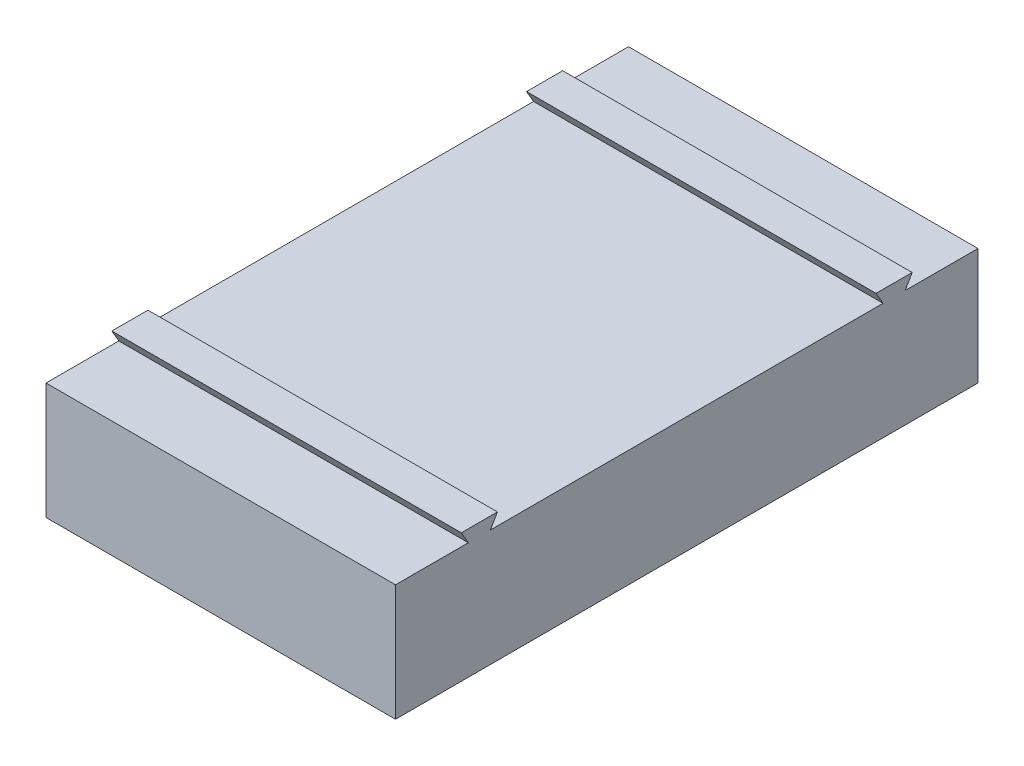
ISO-10303-21;
HEADER;
FILE_DESCRIPTION(('STEP AP214'),'2;1');
FILE_NAME('part.step','',(''),(''),'','','');
FILE_SCHEMA(('AUTOMOTIVE_DESIGN { 1 0 10303 214 1 1 1 1 }'));
ENDSEC;
DATA;
#1=APPLICATION_CONTEXT('core data for automotive mechanical design processes');
#2=APPLICATION_PROTOCOL_DEFINITION('international standard','automotive_design',2000,#1);
#3=PRODUCT_CONTEXT('',#1,'mechanical');
#4=PRODUCT('Part','Part','',(#3));
#5=PRODUCT_RELATED_PRODUCT_CATEGORY('part','',(#4));
#6=PRODUCT_DEFINITION_FORMATION('','',#4);
#7=PRODUCT_DEFINITION_CONTEXT('part definition',#1,'design');
#8=PRODUCT_DEFINITION('design','',#6,#7);
#9=PRODUCT_DEFINITION_SHAPE('','',#8);
#10=(LENGTH_UNIT() NAMED_UNIT(*) SI_UNIT(.MILLI.,.METRE.));
#11=(NAMED_UNIT(*) PLANE_ANGLE_UNIT() SI_UNIT($,.RADIAN.));
#12=(NAMED_UNIT(*) SI_UNIT($,.STERADIAN.) SOLID_ANGLE_UNIT());
#13=UNCERTAINTY_MEASURE_WITH_UNIT(LENGTH_MEASURE(1.E-05),#10,'distance_accuracy_value','');
#14=(GEOMETRIC_REPRESENTATION_CONTEXT(3) GLOBAL_UNCERTAINTY_ASSIGNED_CONTEXT((#13)) GLOBAL_UNIT_ASSIGNED_CONTEXT((#10,
#11,#12)) REPRESENTATION_CONTEXT('',''));
#15=CARTESIAN_POINT('',(0.,0.,0.));
#16=DIRECTION('',(0.,0.,1.));
#17=DIRECTION('',(1.,0.,0.));
#18=AXIS2_PLACEMENT_3D('',#15,#16,#17);
#19=CARTESIAN_POINT('',(0.,40.,0.));
#20=DIRECTION('',(0.,1.,0.));
#21=DIRECTION('',(0.,0.,1.));
#22=AXIS2_PLACEMENT_3D('',#19,#20,#21);
#23=PLANE('',#22);
#24=DIRECTION('',(1.,0.,0.));
#25=VECTOR('',#24,1.);
#26=CARTESIAN_POINT('',(-73.0825745851545,40.,67.4));
#27=LINE('',#26,#25);
#28=CARTESIAN_POINT('',(-60.,40.,67.4));
#29=VERTEX_POINT('',#28);
#30=CARTESIAN_POINT('',(60.,40.,67.4));
#31=VERTEX_POINT('',#30);
#32=EDGE_CURVE('E59',#29,#31,#27,.T.);
#33=ORIENTED_EDGE('',*,*,#32,.T.);
#34=DIRECTION('',(0.,0.,-1.));
#35=VECTOR('',#34,1.);
#36=CARTESIAN_POINT('',(60.,40.,100.));
#37=LINE('',#36,#35);
#38=CARTESIAN_POINT('',(60.,40.,-67.4));
#39=VERTEX_POINT('',#38);
#40=EDGE_CURVE('E289',#31,#39,#37,.T.);
#41=ORIENTED_EDGE('',*,*,#40,.T.);
#42=DIRECTION('',(1.,0.,0.));
#43=VECTOR('',#42,1.);
#44=CARTESIAN_POINT('',(-73.0825745851545,40.,-67.4));
#45=LINE('',#44,#43);
#46=CARTESIAN_POINT('',(-60.,40.,-67.4));
#47=VERTEX_POINT('',#46);
#48=EDGE_CURVE('E257',#47,#39,#45,.T.);
#49=ORIENTED_EDGE('',*,*,#48,.F.);
#50=DIRECTION('',(0.,0.,1.));
#51=VECTOR('',#50,1.);
#52=CARTESIAN_POINT('',(-60.,40.,100.));
#53=LINE('',#52,#51);
#54=EDGE_CURVE('E282',#47,#29,#53,.T.);
#55=ORIENTED_EDGE('',*,*,#54,.T.);
#56=EDGE_LOOP('',(#33,#41,#49,#55));
#57=FACE_BOUND('',#56,.T.);
#58=ADVANCED_FACE('F36',(#57),#23,.T.);
#59=CARTESIAN_POINT('',(-60.,40.,-100.));
#60=VERTEX_POINT('',#59);
#61=CARTESIAN_POINT('',(-60.,40.,-75.));
#62=VERTEX_POINT('',#61);
#63=EDGE_CURVE('E279',#60,#62,#53,.T.);
#64=ORIENTED_EDGE('',*,*,#63,.T.);
#65=DIRECTION('',(1.,0.,0.));
#66=VECTOR('',#65,1.);
#67=CARTESIAN_POINT('',(-73.0825745851545,40.,-75.));
#68=LINE('',#67,#66);
#69=CARTESIAN_POINT('',(60.,40.,-75.));
#70=VERTEX_POINT('',#69);
#71=EDGE_CURVE('E268',#62,#70,#68,.T.);
#72=ORIENTED_EDGE('',*,*,#71,.T.);
#73=CARTESIAN_POINT('',(60.,40.,-100.));
#74=VERTEX_POINT('',#73);
#75=EDGE_CURVE('E285',#70,#74,#37,.T.);
#76=ORIENTED_EDGE('',*,*,#75,.T.);
#77=DIRECTION('',(-1.,0.,0.));
#78=VECTOR('',#77,1.);
#79=CARTESIAN_POINT('',(60.,40.,-100.));
#80=LINE('',#79,#78);
#81=EDGE_CURVE('E288',#74,#60,#80,.T.);
#82=ORIENTED_EDGE('',*,*,#81,.T.);
#83=EDGE_LOOP('',(#64,#72,#76,#82));
#84=FACE_BOUND('',#83,.T.);
#85=ADVANCED_FACE('F327',(#84),#23,.T.);
#86=CARTESIAN_POINT('',(-60.,40.,100.));
#87=DIRECTION('',(1.,0.,0.));
#88=DIRECTION('',(0.,0.,-1.));
#89=AXIS2_PLACEMENT_3D('',#86,#87,#88);
#90=PLANE('',#89);
#91=DIRECTION('',(0.,0.,1.));
#92=VECTOR('',#91,1.);
#93=CARTESIAN_POINT('',(-60.,0.,100.));
#94=LINE('',#93,#92);
#95=CARTESIAN_POINT('',(-60.,0.,-100.));
#96=VERTEX_POINT('',#95);
#97=CARTESIAN_POINT('',(-60.,0.,100.));
#98=VERTEX_POINT('',#97);
#99=EDGE_CURVE('E278',#96,#98,#94,.T.);
#100=ORIENTED_EDGE('',*,*,#99,.T.);
#101=DIRECTION('',(0.,-1.,0.));
#102=VECTOR('',#101,1.);
#103=CARTESIAN_POINT('',(-60.,40.,100.));
#104=LINE('',#103,#102);
#105=CARTESIAN_POINT('',(-60.,40.,100.));
#106=VERTEX_POINT('',#105);
#107=EDGE_CURVE('E11',#106,#98,#104,.T.);
#108=ORIENTED_EDGE('',*,*,#107,.F.);
#109=CARTESIAN_POINT('',(-60.,40.,75.));
#110=VERTEX_POINT('',#109);
#111=EDGE_CURVE('E283',#110,#106,#53,.T.);
#112=ORIENTED_EDGE('',*,*,#111,.F.);
#113=DIRECTION('',(0.,0.866025403784436,0.500000000000005));
#114=VECTOR('',#113,1.);
#115=CARTESIAN_POINT('',(-60.,40.,75.));
#116=LINE('',#115,#114);
#117=CARTESIAN_POINT('',(-60.,44.16,77.4017771198289));
#118=VERTEX_POINT('',#117);
#119=EDGE_CURVE('E230',#110,#118,#116,.T.);
#120=ORIENTED_EDGE('',*,*,#119,.T.);
#121=DIRECTION('',(0.,0.,-1.));
#122=VECTOR('',#121,1.);
#123=CARTESIAN_POINT('',(-60.,44.16,77.4017771198289));
#124=LINE('',#123,#122);
#125=CARTESIAN_POINT('',(-60.,44.16,64.9982228801711));
#126=VERTEX_POINT('',#125);
#127=EDGE_CURVE('E235',#118,#126,#124,.T.);
#128=ORIENTED_EDGE('',*,*,#127,.T.);
#129=DIRECTION('',(0.,-0.866025403784436,0.500000000000004));
#130=VECTOR('',#129,1.);
#131=CARTESIAN_POINT('',(-60.,44.16,64.9982228801711));
#132=LINE('',#131,#130);
#133=EDGE_CURVE('E232',#126,#29,#132,.T.);
#134=ORIENTED_EDGE('',*,*,#133,.T.);
#135=ORIENTED_EDGE('',*,*,#54,.F.);
#136=DIRECTION('',(0.,0.866025403784436,0.500000000000005));
#137=VECTOR('',#136,1.);
#138=CARTESIAN_POINT('',(-60.,40.,-67.4));
#139=LINE('',#138,#137);
#140=CARTESIAN_POINT('',(-60.,44.16,-64.9982228801712));
#141=VERTEX_POINT('',#140);
#142=EDGE_CURVE('E256',#47,#141,#139,.T.);
#143=ORIENTED_EDGE('',*,*,#142,.T.);
#144=DIRECTION('',(0.,0.,-1.));
#145=VECTOR('',#144,1.);
#146=CARTESIAN_POINT('',(-60.,44.16,-64.9982228801712));
#147=LINE('',#146,#145);
#148=CARTESIAN_POINT('',(-60.,44.16,-77.4017771198289));
#149=VERTEX_POINT('',#148);
#150=EDGE_CURVE('E254',#141,#149,#147,.T.);
#151=ORIENTED_EDGE('',*,*,#150,.T.);
#152=DIRECTION('',(0.,-0.866025403784436,0.500000000000005));
#153=VECTOR('',#152,1.);
#154=CARTESIAN_POINT('',(-60.,44.16,-77.4017771198289));
#155=LINE('',#154,#153);
#156=EDGE_CURVE('E259',#149,#62,#155,.T.);
#157=ORIENTED_EDGE('',*,*,#156,.T.);
#158=ORIENTED_EDGE('',*,*,#63,.F.);
#159=DIRECTION('',(0.,-1.,0.));
#160=VECTOR('',#159,1.);
#161=CARTESIAN_POINT('',(-60.,40.,-100.));
#162=LINE('',#161,#160);
#163=EDGE_CURVE('E291',#60,#96,#162,.T.);
#164=ORIENTED_EDGE('',*,*,#163,.T.);
#165=EDGE_LOOP('',(#100,#108,#112,#120,#128,#134,#135,#143,#151,#157,#158,#164));
#166=FACE_BOUND('',#165,.T.);
#167=ADVANCED_FACE('F38',(#166),#90,.F.);
#168=CARTESIAN_POINT('',(60.,40.,100.));
#169=DIRECTION('',(0.,0.,-1.));
#170=DIRECTION('',(-1.,0.,0.));
#171=AXIS2_PLACEMENT_3D('',#168,#169,#170);
#172=PLANE('',#171);
#173=DIRECTION('',(1.,0.,0.));
#174=VECTOR('',#173,1.);
#175=CARTESIAN_POINT('',(60.,0.,100.));
#176=LINE('',#175,#174);
#177=CARTESIAN_POINT('',(60.,0.,100.));
#178=VERTEX_POINT('',#177);
#179=EDGE_CURVE('E294',#98,#178,#176,.T.);
#180=ORIENTED_EDGE('',*,*,#179,.T.);
#181=DIRECTION('',(0.,-1.,0.));
#182=VECTOR('',#181,1.);
#183=CARTESIAN_POINT('',(60.,40.,100.));
#184=LINE('',#183,#182);
#185=CARTESIAN_POINT('',(60.,40.,100.));
#186=VERTEX_POINT('',#185);
#187=EDGE_CURVE('E44',#186,#178,#184,.T.);
#188=ORIENTED_EDGE('',*,*,#187,.F.);
#189=DIRECTION('',(1.,0.,0.));
#190=VECTOR('',#189,1.);
#191=CARTESIAN_POINT('',(60.,40.,100.));
#192=LINE('',#191,#190);
#193=EDGE_CURVE('E281',#106,#186,#192,.T.);
#194=ORIENTED_EDGE('',*,*,#193,.F.);
#195=ORIENTED_EDGE('',*,*,#107,.T.);
#196=EDGE_LOOP('',(#180,#188,#194,#195));
#197=FACE_BOUND('',#196,.T.);
#198=ADVANCED_FACE('F347',(#197),#172,.F.);
#199=CARTESIAN_POINT('',(60.,40.,100.));
#200=DIRECTION('',(-1.,0.,0.));
#201=DIRECTION('',(0.,0.,1.));
#202=AXIS2_PLACEMENT_3D('',#199,#200,#201);
#203=PLANE('',#202);
#204=DIRECTION('',(0.,0.,-1.));
#205=VECTOR('',#204,1.);
#206=CARTESIAN_POINT('',(60.,0.,100.));
#207=LINE('',#206,#205);
#208=CARTESIAN_POINT('',(60.,0.,-100.));
#209=VERTEX_POINT('',#208);
#210=EDGE_CURVE('E296',#178,#209,#207,.T.);
#211=ORIENTED_EDGE('',*,*,#210,.T.);
#212=DIRECTION('',(0.,-1.,0.));
#213=VECTOR('',#212,1.);
#214=CARTESIAN_POINT('',(60.,40.,-100.));
#215=LINE('',#214,#213);
#216=EDGE_CURVE('E302',#74,#209,#215,.T.);
#217=ORIENTED_EDGE('',*,*,#216,.F.);
#218=ORIENTED_EDGE('',*,*,#75,.F.);
#219=DIRECTION('',(0.,0.866025403784436,-0.500000000000005));
#220=VECTOR('',#219,1.);
#221=CARTESIAN_POINT('',(60.,44.16,-77.4017771198289));
#222=LINE('',#221,#220);
#223=CARTESIAN_POINT('',(60.,44.16,-77.4017771198289));
#224=VERTEX_POINT('',#223);
#225=EDGE_CURVE('E253',#70,#224,#222,.T.);
#226=ORIENTED_EDGE('',*,*,#225,.T.);
#227=DIRECTION('',(0.,0.,1.));
#228=VECTOR('',#227,1.);
#229=CARTESIAN_POINT('',(60.,44.16,-64.9982228801712));
#230=LINE('',#229,#228);
#231=CARTESIAN_POINT('',(60.,44.16,-64.9982228801712));
#232=VERTEX_POINT('',#231);
#233=EDGE_CURVE('E262',#224,#232,#230,.T.);
#234=ORIENTED_EDGE('',*,*,#233,.T.);
#235=DIRECTION('',(0.,-0.866025403784436,-0.500000000000005));
#236=VECTOR('',#235,1.);
#237=CARTESIAN_POINT('',(60.,40.,-67.4));
#238=LINE('',#237,#236);
#239=EDGE_CURVE('E265',#232,#39,#238,.T.);
#240=ORIENTED_EDGE('',*,*,#239,.T.);
#241=ORIENTED_EDGE('',*,*,#40,.F.);
#242=DIRECTION('',(0.,0.866025403784436,-0.500000000000004));
#243=VECTOR('',#242,1.);
#244=CARTESIAN_POINT('',(60.,44.16,64.9982228801711));
#245=LINE('',#244,#243);
#246=CARTESIAN_POINT('',(60.,44.16,64.9982228801711));
#247=VERTEX_POINT('',#246);
#248=EDGE_CURVE('E220',#31,#247,#245,.T.);
#249=ORIENTED_EDGE('',*,*,#248,.T.);
#250=DIRECTION('',(0.,0.,1.));
#251=VECTOR('',#250,1.);
#252=CARTESIAN_POINT('',(60.,44.16,77.4017771198289));
#253=LINE('',#252,#251);
#254=CARTESIAN_POINT('',(60.,44.16,77.4017771198289));
#255=VERTEX_POINT('',#254);
#256=EDGE_CURVE('E238',#247,#255,#253,.T.);
#257=ORIENTED_EDGE('',*,*,#256,.T.);
#258=DIRECTION('',(0.,-0.866025403784436,-0.500000000000005));
#259=VECTOR('',#258,1.);
#260=CARTESIAN_POINT('',(60.,40.,75.));
#261=LINE('',#260,#259);
#262=CARTESIAN_POINT('',(60.,40.,75.));
#263=VERTEX_POINT('',#262);
#264=EDGE_CURVE('E241',#255,#263,#261,.T.);
#265=ORIENTED_EDGE('',*,*,#264,.T.);
#266=EDGE_CURVE('E286',#186,#263,#37,.T.);
#267=ORIENTED_EDGE('',*,*,#266,.F.);
#268=ORIENTED_EDGE('',*,*,#187,.T.);
#269=EDGE_LOOP('',(#211,#217,#218,#226,#234,#240,#241,#249,#257,#265,#267,#268));
#270=FACE_BOUND('',#269,.T.);
#271=ADVANCED_FACE('F309',(#270),#203,.F.);
#272=CARTESIAN_POINT('',(60.,40.,-100.));
#273=DIRECTION('',(0.,0.,1.));
#274=DIRECTION('',(1.,0.,0.));
#275=AXIS2_PLACEMENT_3D('',#272,#273,#274);
#276=PLANE('',#275);
#277=DIRECTION('',(-1.,0.,0.));
#278=VECTOR('',#277,1.);
#279=CARTESIAN_POINT('',(60.,0.,-100.));
#280=LINE('',#279,#278);
#281=EDGE_CURVE('E298',#209,#96,#280,.T.);
#282=ORIENTED_EDGE('',*,*,#281,.T.);
#283=ORIENTED_EDGE('',*,*,#163,.F.);
#284=ORIENTED_EDGE('',*,*,#81,.F.);
#285=ORIENTED_EDGE('',*,*,#216,.T.);
#286=EDGE_LOOP('',(#282,#283,#284,#285));
#287=FACE_BOUND('',#286,.T.);
#288=ADVANCED_FACE('F319',(#287),#276,.F.);
#289=DIRECTION('',(1.,0.,0.));
#290=VECTOR('',#289,1.);
#291=CARTESIAN_POINT('',(-73.0825745851545,40.,75.));
#292=LINE('',#291,#290);
#293=EDGE_CURVE('E246',#110,#263,#292,.T.);
#294=ORIENTED_EDGE('',*,*,#293,.F.);
#295=ORIENTED_EDGE('',*,*,#111,.T.);
#296=ORIENTED_EDGE('',*,*,#193,.T.);
#297=ORIENTED_EDGE('',*,*,#266,.T.);
#298=EDGE_LOOP('',(#294,#295,#296,#297));
#299=FACE_BOUND('',#298,.T.);
#300=ADVANCED_FACE('F345',(#299),#23,.T.);
#301=CARTESIAN_POINT('',(0.,0.,0.));
#302=DIRECTION('',(0.,1.,0.));
#303=DIRECTION('',(0.,0.,1.));
#304=AXIS2_PLACEMENT_3D('',#301,#302,#303);
#305=PLANE('',#304);
#306=DIRECTION('',(0.,0.,1.));
#307=VECTOR('',#306,1.);
#308=CARTESIAN_POINT('',(10.8887433026897,0.,13.3243832519748));
#309=LINE('',#308,#307);
#310=CARTESIAN_POINT('',(10.8887433026897,0.,-30.1350746666546));
#311=VERTEX_POINT('',#310);
#312=CARTESIAN_POINT('',(10.8887433026897,0.,13.3243832519748));
#313=VERTEX_POINT('',#312);
#314=EDGE_CURVE('E205',#311,#313,#309,.T.);
#315=ORIENTED_EDGE('',*,*,#314,.F.);
#316=DIRECTION('',(1.,0.,0.));
#317=VECTOR('',#316,1.);
#318=CARTESIAN_POINT('',(10.8887433026897,0.,-30.1350746666546));
#319=LINE('',#318,#317);
#320=CARTESIAN_POINT('',(-10.8887433026829,0.,-30.1350746666546));
#321=VERTEX_POINT('',#320);
#322=EDGE_CURVE('E51',#321,#311,#319,.T.);
#323=ORIENTED_EDGE('',*,*,#322,.F.);
#324=DIRECTION('',(0.,0.,-1.));
#325=VECTOR('',#324,1.);
#326=CARTESIAN_POINT('',(-10.8887433026829,0.,-30.1350746666546));
#327=LINE('',#326,#325);
#328=CARTESIAN_POINT('',(-10.8887433026829,0.,13.3243832519748));
#329=VERTEX_POINT('',#328);
#330=EDGE_CURVE('E188',#329,#321,#327,.T.);
#331=ORIENTED_EDGE('',*,*,#330,.F.);
#332=DIRECTION('',(1.,0.,0.));
#333=VECTOR('',#332,1.);
#334=CARTESIAN_POINT('',(-10.8887433026829,0.,13.3243832519748));
#335=LINE('',#334,#333);
#336=CARTESIAN_POINT('',(-25.4837020685664,0.,13.3243832519748));
#337=VERTEX_POINT('',#336);
#338=EDGE_CURVE('E191',#337,#329,#335,.T.);
#339=ORIENTED_EDGE('',*,*,#338,.F.);
#340=DIRECTION('',(-0.683415844772554,0.,-0.73002930291449));
#341=VECTOR('',#340,1.);
#342=CARTESIAN_POINT('',(-25.4837020685664,0.,13.3243832519748));
#343=LINE('',#342,#341);
#344=CARTESIAN_POINT('',(3.41637121107795E-12,0.,40.5462415087));
#345=VERTEX_POINT('',#344);
#346=EDGE_CURVE('E213',#345,#337,#343,.T.);
#347=ORIENTED_EDGE('',*,*,#346,.F.);
#348=DIRECTION('',(-0.683415844772554,0.,0.73002930291449));
#349=VECTOR('',#348,1.);
#350=CARTESIAN_POINT('',(3.41637121107795E-12,0.,40.5462415087));
#351=LINE('',#350,#349);
#352=CARTESIAN_POINT('',(25.4837020685733,0.,13.3243832519748));
#353=VERTEX_POINT('',#352);
#354=EDGE_CURVE('E210',#353,#345,#351,.T.);
#355=ORIENTED_EDGE('',*,*,#354,.F.);
#356=DIRECTION('',(1.,0.,0.));
#357=VECTOR('',#356,1.);
#358=CARTESIAN_POINT('',(25.4837020685733,0.,13.3243832519748));
#359=LINE('',#358,#357);
#360=EDGE_CURVE('E207',#313,#353,#359,.T.);
#361=ORIENTED_EDGE('',*,*,#360,.F.);
#362=EDGE_LOOP('',(#315,#323,#331,#339,#347,#355,#361));
#363=FACE_BOUND('',#362,.T.);
#364=ORIENTED_EDGE('',*,*,#99,.F.);
#365=ORIENTED_EDGE('',*,*,#281,.F.);
#366=ORIENTED_EDGE('',*,*,#210,.F.);
#367=ORIENTED_EDGE('',*,*,#179,.F.);
#368=EDGE_LOOP('',(#364,#365,#366,#367));
#369=FACE_BOUND('',#368,.T.);
#370=ADVANCED_FACE('F316',(#363,#369),#305,.F.);
#371=CARTESIAN_POINT('',(-73.0825745851545,40.,-67.4));
#372=DIRECTION('',(0.,-0.500000000000005,0.866025403784436));
#373=DIRECTION('',(0.,-0.866025403784436,-0.500000000000005));
#374=AXIS2_PLACEMENT_3D('',#371,#372,#373);
#375=PLANE('',#374);
#376=ORIENTED_EDGE('',*,*,#142,.F.);
#377=ORIENTED_EDGE('',*,*,#48,.T.);
#378=ORIENTED_EDGE('',*,*,#239,.F.);
#379=DIRECTION('',(1.,0.,0.));
#380=VECTOR('',#379,1.);
#381=CARTESIAN_POINT('',(-73.0825745851545,44.16,-64.9982228801712));
#382=LINE('',#381,#380);
#383=EDGE_CURVE('E271',#141,#232,#382,.T.);
#384=ORIENTED_EDGE('',*,*,#383,.F.);
#385=EDGE_LOOP('',(#376,#377,#378,#384));
#386=FACE_BOUND('',#385,.T.);
#387=ADVANCED_FACE('F335',(#386),#375,.T.);
#388=CARTESIAN_POINT('',(-73.0825745851545,44.16,-64.9982228801712));
#389=DIRECTION('',(0.,1.,0.));
#390=DIRECTION('',(0.,0.,1.));
#391=AXIS2_PLACEMENT_3D('',#388,#389,#390);
#392=PLANE('',#391);
#393=ORIENTED_EDGE('',*,*,#150,.F.);
#394=ORIENTED_EDGE('',*,*,#383,.T.);
#395=ORIENTED_EDGE('',*,*,#233,.F.);
#396=DIRECTION('',(1.,0.,0.));
#397=VECTOR('',#396,1.);
#398=CARTESIAN_POINT('',(-73.0825745851545,44.16,-77.4017771198289));
#399=LINE('',#398,#397);
#400=EDGE_CURVE('E273',#149,#224,#399,.T.);
#401=ORIENTED_EDGE('',*,*,#400,.F.);
#402=EDGE_LOOP('',(#393,#394,#395,#401));
#403=FACE_BOUND('',#402,.T.);
#404=ADVANCED_FACE('F341',(#403),#392,.T.);
#405=CARTESIAN_POINT('',(-73.0825745851545,44.16,-77.4017771198289));
#406=DIRECTION('',(0.,-0.500000000000005,-0.866025403784436));
#407=DIRECTION('',(0.,0.866025403784436,-0.500000000000005));
#408=AXIS2_PLACEMENT_3D('',#405,#406,#407);
#409=PLANE('',#408);
#410=ORIENTED_EDGE('',*,*,#156,.F.);
#411=ORIENTED_EDGE('',*,*,#400,.T.);
#412=ORIENTED_EDGE('',*,*,#225,.F.);
#413=ORIENTED_EDGE('',*,*,#71,.F.);
#414=EDGE_LOOP('',(#410,#411,#412,#413));
#415=FACE_BOUND('',#414,.T.);
#416=ADVANCED_FACE('F402',(#415),#409,.T.);
#417=CARTESIAN_POINT('',(-73.0825745851545,44.16,64.9982228801711));
#418=DIRECTION('',(0.,-0.500000000000004,-0.866025403784436));
#419=DIRECTION('',(0.,0.866025403784436,-0.500000000000004));
#420=AXIS2_PLACEMENT_3D('',#417,#418,#419);
#421=PLANE('',#420);
#422=ORIENTED_EDGE('',*,*,#133,.F.);
#423=DIRECTION('',(1.,0.,0.));
#424=VECTOR('',#423,1.);
#425=CARTESIAN_POINT('',(-73.0825745851545,44.16,64.9982228801711));
#426=LINE('',#425,#424);
#427=EDGE_CURVE('E244',#126,#247,#426,.T.);
#428=ORIENTED_EDGE('',*,*,#427,.T.);
#429=ORIENTED_EDGE('',*,*,#248,.F.);
#430=ORIENTED_EDGE('',*,*,#32,.F.);
#431=EDGE_LOOP('',(#422,#428,#429,#430));
#432=FACE_BOUND('',#431,.T.);
#433=ADVANCED_FACE('F411',(#432),#421,.T.);
#434=CARTESIAN_POINT('',(-73.0825745851545,40.,75.));
#435=DIRECTION('',(0.,-0.500000000000005,0.866025403784436));
#436=DIRECTION('',(0.,-0.866025403784436,-0.500000000000005));
#437=AXIS2_PLACEMENT_3D('',#434,#435,#436);
#438=PLANE('',#437);
#439=ORIENTED_EDGE('',*,*,#119,.F.);
#440=ORIENTED_EDGE('',*,*,#293,.T.);
#441=ORIENTED_EDGE('',*,*,#264,.F.);
#442=DIRECTION('',(1.,0.,0.));
#443=VECTOR('',#442,1.);
#444=CARTESIAN_POINT('',(-73.0825745851545,44.16,77.4017771198289));
#445=LINE('',#444,#443);
#446=EDGE_CURVE('E249',#118,#255,#445,.T.);
#447=ORIENTED_EDGE('',*,*,#446,.F.);
#448=EDGE_LOOP('',(#439,#440,#441,#447));
#449=FACE_BOUND('',#448,.T.);
#450=ADVANCED_FACE('F420',(#449),#438,.T.);
#451=CARTESIAN_POINT('',(-73.0825745851545,44.16,77.4017771198289));
#452=DIRECTION('',(0.,1.,0.));
#453=DIRECTION('',(0.,0.,1.));
#454=AXIS2_PLACEMENT_3D('',#451,#452,#453);
#455=PLANE('',#454);
#456=ORIENTED_EDGE('',*,*,#127,.F.);
#457=ORIENTED_EDGE('',*,*,#446,.T.);
#458=ORIENTED_EDGE('',*,*,#256,.F.);
#459=ORIENTED_EDGE('',*,*,#427,.F.);
#460=EDGE_LOOP('',(#456,#457,#458,#459));
#461=FACE_BOUND('',#460,.T.);
#462=ADVANCED_FACE('F430',(#461),#455,.T.);
#463=CARTESIAN_POINT('',(10.8887433026897,1.,-30.1350746666546));
#464=DIRECTION('',(0.,0.,-1.));
#465=DIRECTION('',(-1.,0.,0.));
#466=AXIS2_PLACEMENT_3D('',#463,#464,#465);
#467=PLANE('',#466);
#468=ORIENTED_EDGE('',*,*,#322,.T.);
#469=DIRECTION('',(0.,-1.,0.));
#470=VECTOR('',#469,1.);
#471=CARTESIAN_POINT('',(10.8887433026897,1.,-30.1350746666546));
#472=LINE('',#471,#470);
#473=CARTESIAN_POINT('',(10.8887433026897,1.,-30.1350746666546));
#474=VERTEX_POINT('',#473);
#475=EDGE_CURVE('E165',#474,#311,#472,.T.);
#476=ORIENTED_EDGE('',*,*,#475,.F.);
#477=DIRECTION('',(1.,0.,0.));
#478=VECTOR('',#477,1.);
#479=CARTESIAN_POINT('',(10.8887433026897,1.,-30.1350746666546));
#480=LINE('',#479,#478);
#481=CARTESIAN_POINT('',(-10.8887433026829,1.,-30.1350746666546));
#482=VERTEX_POINT('',#481);
#483=EDGE_CURVE('E169',#482,#474,#480,.T.);
#484=ORIENTED_EDGE('',*,*,#483,.F.);
#485=DIRECTION('',(0.,-1.,0.));
#486=VECTOR('',#485,1.);
#487=CARTESIAN_POINT('',(-10.8887433026829,1.,-30.1350746666546));
#488=LINE('',#487,#486);
#489=EDGE_CURVE('E218',#482,#321,#488,.T.);
#490=ORIENTED_EDGE('',*,*,#489,.T.);
#491=EDGE_LOOP('',(#468,#476,#484,#490));
#492=FACE_BOUND('',#491,.T.);
#493=ADVANCED_FACE('F167',(#492),#467,.F.);
#494=CARTESIAN_POINT('',(-10.8887433026829,1.,-30.1350746666546));
#495=DIRECTION('',(-1.,0.,0.));
#496=DIRECTION('',(0.,0.,1.));
#497=AXIS2_PLACEMENT_3D('',#494,#495,#496);
#498=PLANE('',#497);
#499=ORIENTED_EDGE('',*,*,#330,.T.);
#500=ORIENTED_EDGE('',*,*,#489,.F.);
#501=DIRECTION('',(0.,0.,-1.));
#502=VECTOR('',#501,1.);
#503=CARTESIAN_POINT('',(-10.8887433026829,1.,-30.1350746666546));
#504=LINE('',#503,#502);
#505=CARTESIAN_POINT('',(-10.8887433026829,1.,13.3243832519748));
#506=VERTEX_POINT('',#505);
#507=EDGE_CURVE('E175',#506,#482,#504,.T.);
#508=ORIENTED_EDGE('',*,*,#507,.F.);
#509=DIRECTION('',(0.,-1.,0.));
#510=VECTOR('',#509,1.);
#511=CARTESIAN_POINT('',(-10.8887433026829,1.,13.3243832519748));
#512=LINE('',#511,#510);
#513=EDGE_CURVE('E221',#506,#329,#512,.T.);
#514=ORIENTED_EDGE('',*,*,#513,.T.);
#515=EDGE_LOOP('',(#499,#500,#508,#514));
#516=FACE_BOUND('',#515,.T.);
#517=ADVANCED_FACE('F455',(#516),#498,.F.);
#518=CARTESIAN_POINT('',(-10.8887433026829,1.,13.3243832519748));
#519=DIRECTION('',(0.,0.,-1.));
#520=DIRECTION('',(-1.,0.,0.));
#521=AXIS2_PLACEMENT_3D('',#518,#519,#520);
#522=PLANE('',#521);
#523=ORIENTED_EDGE('',*,*,#338,.T.);
#524=ORIENTED_EDGE('',*,*,#513,.F.);
#525=DIRECTION('',(1.,0.,0.));
#526=VECTOR('',#525,1.);
#527=CARTESIAN_POINT('',(-10.8887433026829,1.,13.3243832519748));
#528=LINE('',#527,#526);
#529=CARTESIAN_POINT('',(-25.4837020685664,1.,13.3243832519748));
#530=VERTEX_POINT('',#529);
#531=EDGE_CURVE('E201',#530,#506,#528,.T.);
#532=ORIENTED_EDGE('',*,*,#531,.F.);
#533=DIRECTION('',(0.,-1.,0.));
#534=VECTOR('',#533,1.);
#535=CARTESIAN_POINT('',(-25.4837020685664,1.,13.3243832519748));
#536=LINE('',#535,#534);
#537=EDGE_CURVE('E223',#530,#337,#536,.T.);
#538=ORIENTED_EDGE('',*,*,#537,.T.);
#539=EDGE_LOOP('',(#523,#524,#532,#538));
#540=FACE_BOUND('',#539,.T.);
#541=ADVANCED_FACE('F464',(#540),#522,.F.);
#542=CARTESIAN_POINT('',(-25.4837020685664,1.,13.3243832519748));
#543=DIRECTION('',(-0.73002930291449,0.,0.683415844772554));
#544=DIRECTION('',(0.683415844772554,0.,0.73002930291449));
#545=AXIS2_PLACEMENT_3D('',#542,#543,#544);
#546=PLANE('',#545);
#547=ORIENTED_EDGE('',*,*,#346,.T.);
#548=ORIENTED_EDGE('',*,*,#537,.F.);
#549=DIRECTION('',(-0.683415844772554,0.,-0.73002930291449));
#550=VECTOR('',#549,1.);
#551=CARTESIAN_POINT('',(-25.4837020685664,1.,13.3243832519748));
#552=LINE('',#551,#550);
#553=CARTESIAN_POINT('',(3.41637121107795E-12,1.,40.5462415087));
#554=VERTEX_POINT('',#553);
#555=EDGE_CURVE('E198',#554,#530,#552,.T.);
#556=ORIENTED_EDGE('',*,*,#555,.F.);
#557=DIRECTION('',(0.,-1.,0.));
#558=VECTOR('',#557,1.);
#559=CARTESIAN_POINT('',(3.41637121107795E-12,1.,40.5462415087));
#560=LINE('',#559,#558);
#561=EDGE_CURVE('E225',#554,#345,#560,.T.);
#562=ORIENTED_EDGE('',*,*,#561,.T.);
#563=EDGE_LOOP('',(#547,#548,#556,#562));
#564=FACE_BOUND('',#563,.T.);
#565=ADVANCED_FACE('F474',(#564),#546,.F.);
#566=CARTESIAN_POINT('',(3.41637121107795E-12,1.,40.5462415087));
#567=DIRECTION('',(0.73002930291449,0.,0.683415844772554));
#568=DIRECTION('',(0.683415844772554,0.,-0.73002930291449));
#569=AXIS2_PLACEMENT_3D('',#566,#567,#568);
#570=PLANE('',#569);
#571=ORIENTED_EDGE('',*,*,#354,.T.);
#572=ORIENTED_EDGE('',*,*,#561,.F.);
#573=DIRECTION('',(-0.683415844772554,0.,0.73002930291449));
#574=VECTOR('',#573,1.);
#575=CARTESIAN_POINT('',(3.41637121107795E-12,1.,40.5462415087));
#576=LINE('',#575,#574);
#577=CARTESIAN_POINT('',(25.4837020685733,1.,13.3243832519748));
#578=VERTEX_POINT('',#577);
#579=EDGE_CURVE('E195',#578,#554,#576,.T.);
#580=ORIENTED_EDGE('',*,*,#579,.F.);
#581=DIRECTION('',(0.,-1.,0.));
#582=VECTOR('',#581,1.);
#583=CARTESIAN_POINT('',(25.4837020685733,1.,13.3243832519748));
#584=LINE('',#583,#582);
#585=EDGE_CURVE('E227',#578,#353,#584,.T.);
#586=ORIENTED_EDGE('',*,*,#585,.T.);
#587=EDGE_LOOP('',(#571,#572,#580,#586));
#588=FACE_BOUND('',#587,.T.);
#589=ADVANCED_FACE('F484',(#588),#570,.F.);
#590=CARTESIAN_POINT('',(25.4837020685733,1.,13.3243832519748));
#591=DIRECTION('',(0.,0.,-1.));
#592=DIRECTION('',(-1.,0.,0.));
#593=AXIS2_PLACEMENT_3D('',#590,#591,#592);
#594=PLANE('',#593);
#595=ORIENTED_EDGE('',*,*,#360,.T.);
#596=ORIENTED_EDGE('',*,*,#585,.F.);
#597=DIRECTION('',(1.,0.,0.));
#598=VECTOR('',#597,1.);
#599=CARTESIAN_POINT('',(25.4837020685733,1.,13.3243832519748));
#600=LINE('',#599,#598);
#601=CARTESIAN_POINT('',(10.8887433026897,1.,13.3243832519748));
#602=VERTEX_POINT('',#601);
#603=EDGE_CURVE('E183',#602,#578,#600,.T.);
#604=ORIENTED_EDGE('',*,*,#603,.F.);
#605=DIRECTION('',(0.,-1.,0.));
#606=VECTOR('',#605,1.);
#607=CARTESIAN_POINT('',(10.8887433026897,1.,13.3243832519748));
#608=LINE('',#607,#606);
#609=EDGE_CURVE('E174',#602,#313,#608,.T.);
#610=ORIENTED_EDGE('',*,*,#609,.T.);
#611=EDGE_LOOP('',(#595,#596,#604,#610));
#612=FACE_BOUND('',#611,.T.);
#613=ADVANCED_FACE('F494',(#612),#594,.F.);
#614=CARTESIAN_POINT('',(10.8887433026897,1.,13.3243832519748));
#615=DIRECTION('',(1.,0.,0.));
#616=DIRECTION('',(0.,0.,-1.));
#617=AXIS2_PLACEMENT_3D('',#614,#615,#616);
#618=PLANE('',#617);
#619=ORIENTED_EDGE('',*,*,#314,.T.);
#620=ORIENTED_EDGE('',*,*,#609,.F.);
#621=DIRECTION('',(0.,0.,1.));
#622=VECTOR('',#621,1.);
#623=CARTESIAN_POINT('',(10.8887433026897,1.,13.3243832519748));
#624=LINE('',#623,#622);
#625=EDGE_CURVE('E178',#474,#602,#624,.T.);
#626=ORIENTED_EDGE('',*,*,#625,.F.);
#627=ORIENTED_EDGE('',*,*,#475,.T.);
#628=EDGE_LOOP('',(#619,#620,#626,#627));
#629=FACE_BOUND('',#628,.T.);
#630=ADVANCED_FACE('F179',(#629),#618,.F.);
#631=CARTESIAN_POINT('',(0.,1.,0.));
#632=DIRECTION('',(0.,1.,0.));
#633=DIRECTION('',(0.,0.,1.));
#634=AXIS2_PLACEMENT_3D('',#631,#632,#633);
#635=PLANE('',#634);
#636=ORIENTED_EDGE('',*,*,#483,.T.);
#637=ORIENTED_EDGE('',*,*,#625,.T.);
#638=ORIENTED_EDGE('',*,*,#603,.T.);
#639=ORIENTED_EDGE('',*,*,#579,.T.);
#640=ORIENTED_EDGE('',*,*,#555,.T.);
#641=ORIENTED_EDGE('',*,*,#531,.T.);
#642=ORIENTED_EDGE('',*,*,#507,.T.);
#643=EDGE_LOOP('',(#636,#637,#638,#639,#640,#641,#642));
#644=FACE_BOUND('',#643,.T.);
#645=ADVANCED_FACE('F185',(#644),#635,.F.);
#646=CLOSED_SHELL('',(#58,#85,#167,#198,#271,#288,#300,#370,#387,#404,#416,#433,#450,#462,#493,
#517,#541,#565,#589,#613,#630,#645));
#647=MANIFOLD_SOLID_BREP('B2',#646);
#648=ADVANCED_BREP_SHAPE_REPRESENTATION('',(#18,#647),#14);
#649=SHAPE_DEFINITION_REPRESENTATION(#9,#648);
ENDSEC;
END-ISO-10303-21;
